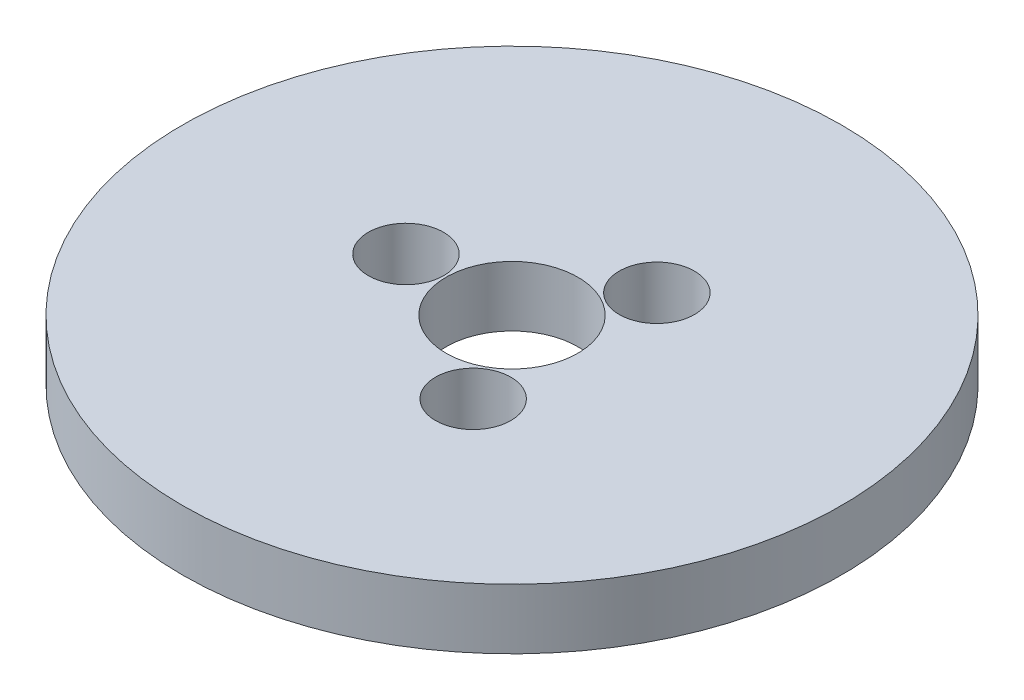
ISO-10303-21;
HEADER;
FILE_DESCRIPTION(('STEP AP214'),'2;1');
FILE_NAME('part.step','',(''),(''),'','','');
FILE_SCHEMA(('AUTOMOTIVE_DESIGN { 1 0 10303 214 1 1 1 1 }'));
ENDSEC;
DATA;
#1=APPLICATION_CONTEXT('core data for automotive mechanical design processes');
#2=APPLICATION_PROTOCOL_DEFINITION('international standard','automotive_design',2000,#1);
#3=PRODUCT_CONTEXT('',#1,'mechanical');
#4=PRODUCT('Part','Part','',(#3));
#5=PRODUCT_RELATED_PRODUCT_CATEGORY('part','',(#4));
#6=PRODUCT_DEFINITION_FORMATION('','',#4);
#7=PRODUCT_DEFINITION_CONTEXT('part definition',#1,'design');
#8=PRODUCT_DEFINITION('design','',#6,#7);
#9=PRODUCT_DEFINITION_SHAPE('','',#8);
#10=(LENGTH_UNIT() NAMED_UNIT(*) SI_UNIT(.MILLI.,.METRE.));
#11=(NAMED_UNIT(*) PLANE_ANGLE_UNIT() SI_UNIT($,.RADIAN.));
#12=(NAMED_UNIT(*) SI_UNIT($,.STERADIAN.) SOLID_ANGLE_UNIT());
#13=UNCERTAINTY_MEASURE_WITH_UNIT(LENGTH_MEASURE(1.E-05),#10,'distance_accuracy_value','');
#14=(GEOMETRIC_REPRESENTATION_CONTEXT(3) GLOBAL_UNCERTAINTY_ASSIGNED_CONTEXT((#13)) GLOBAL_UNIT_ASSIGNED_CONTEXT((#10,
#11,#12)) REPRESENTATION_CONTEXT('',''));
#15=CARTESIAN_POINT('',(0.,0.,0.));
#16=DIRECTION('',(0.,0.,1.));
#17=DIRECTION('',(1.,0.,0.));
#18=AXIS2_PLACEMENT_3D('',#15,#16,#17);
#19=CARTESIAN_POINT('',(0.,16.,0.));
#20=DIRECTION('',(0.,-1.,0.));
#21=DIRECTION('',(0.,0.,-1.));
#22=AXIS2_PLACEMENT_3D('',#19,#20,#21);
#23=CYLINDRICAL_SURFACE('',#22,87.5);
#24=CARTESIAN_POINT('',(0.,16.,0.));
#25=DIRECTION('',(0.,1.,0.));
#26=DIRECTION('',(0.,0.,1.));
#27=AXIS2_PLACEMENT_3D('',#24,#25,#26);
#28=CIRCLE('',#27,87.5);
#29=CARTESIAN_POINT('',(0.,16.,87.5));
#30=VERTEX_POINT('',#29);
#31=EDGE_CURVE('E10',#30,#30,#28,.T.);
#32=ORIENTED_EDGE('',*,*,#31,.F.);
#33=EDGE_LOOP('',(#32));
#34=FACE_BOUND('',#33,.T.);
#35=CARTESIAN_POINT('',(0.,0.,0.));
#36=DIRECTION('',(0.,1.,0.));
#37=DIRECTION('',(0.,0.,1.));
#38=AXIS2_PLACEMENT_3D('',#35,#36,#37);
#39=CIRCLE('',#38,87.5);
#40=CARTESIAN_POINT('',(0.,0.,87.5));
#41=VERTEX_POINT('',#40);
#42=EDGE_CURVE('E37',#41,#41,#39,.T.);
#43=ORIENTED_EDGE('',*,*,#42,.T.);
#44=EDGE_LOOP('',(#43));
#45=FACE_BOUND('',#44,.T.);
#46=ADVANCED_FACE('F40',(#34,#45),#23,.T.);
#47=CARTESIAN_POINT('',(0.,16.,0.));
#48=DIRECTION('',(0.,1.,0.));
#49=DIRECTION('',(0.,0.,1.));
#50=AXIS2_PLACEMENT_3D('',#47,#48,#49);
#51=PLANE('',#50);
#52=CARTESIAN_POINT('',(14.0787727921057,16.,24.3851497841452));
#53=DIRECTION('',(0.,1.,0.));
#54=DIRECTION('',(0.866025403784436,0.,-0.500000000000004));
#55=AXIS2_PLACEMENT_3D('',#52,#53,#54);
#56=CIRCLE('',#55,10.);
#57=CARTESIAN_POINT('',(14.0787727921057,16.,34.3851497841452));
#58=VERTEX_POINT('',#57);
#59=EDGE_CURVE('E70',#58,#58,#56,.T.);
#60=ORIENTED_EDGE('',*,*,#59,.F.);
#61=EDGE_LOOP('',(#60));
#62=FACE_BOUND('',#61,.T.);
#63=CARTESIAN_POINT('',(14.0787727921054,16.,-24.3851497841454));
#64=DIRECTION('',(0.,1.,0.));
#65=DIRECTION('',(-0.866025403784443,0.,-0.499999999999992));
#66=AXIS2_PLACEMENT_3D('',#63,#64,#65);
#67=CIRCLE('',#66,10.);
#68=CARTESIAN_POINT('',(14.0787727921054,16.,-14.3851497841454));
#69=VERTEX_POINT('',#68);
#70=EDGE_CURVE('E61',#69,#69,#67,.T.);
#71=ORIENTED_EDGE('',*,*,#70,.F.);
#72=EDGE_LOOP('',(#71));
#73=FACE_BOUND('',#72,.T.);
#74=CARTESIAN_POINT('',(-28.1575455842112,16.,0.));
#75=DIRECTION('',(0.,1.,0.));
#76=DIRECTION('',(0.,0.,1.));
#77=AXIS2_PLACEMENT_3D('',#74,#75,#76);
#78=CIRCLE('',#77,10.);
#79=CARTESIAN_POINT('',(-28.1575455842112,16.,10.));
#80=VERTEX_POINT('',#79);
#81=EDGE_CURVE('E54',#80,#80,#78,.T.);
#82=ORIENTED_EDGE('',*,*,#81,.F.);
#83=EDGE_LOOP('',(#82));
#84=FACE_BOUND('',#83,.T.);
#85=CARTESIAN_POINT('',(0.,16.,0.));
#86=DIRECTION('',(0.,1.,0.));
#87=DIRECTION('',(0.,0.,1.));
#88=AXIS2_PLACEMENT_3D('',#85,#86,#87);
#89=CIRCLE('',#88,17.5);
#90=CARTESIAN_POINT('',(0.,16.,17.5));
#91=VERTEX_POINT('',#90);
#92=EDGE_CURVE('E50',#91,#91,#89,.T.);
#93=ORIENTED_EDGE('',*,*,#92,.F.);
#94=EDGE_LOOP('',(#93));
#95=FACE_BOUND('',#94,.T.);
#96=ORIENTED_EDGE('',*,*,#31,.T.);
#97=EDGE_LOOP('',(#96));
#98=FACE_BOUND('',#97,.T.);
#99=ADVANCED_FACE('F85',(#62,#73,#84,#95,#98),#51,.T.);
#100=CARTESIAN_POINT('',(0.,0.,0.));
#101=DIRECTION('',(0.,1.,0.));
#102=DIRECTION('',(0.,0.,1.));
#103=AXIS2_PLACEMENT_3D('',#100,#101,#102);
#104=PLANE('',#103);
#105=CARTESIAN_POINT('',(0.,0.,0.));
#106=DIRECTION('',(0.,1.,0.));
#107=DIRECTION('',(0.,0.,1.));
#108=AXIS2_PLACEMENT_3D('',#105,#106,#107);
#109=CIRCLE('',#108,17.5);
#110=CARTESIAN_POINT('',(0.,0.,17.5));
#111=VERTEX_POINT('',#110);
#112=EDGE_CURVE('E47',#111,#111,#109,.T.);
#113=ORIENTED_EDGE('',*,*,#112,.T.);
#114=EDGE_LOOP('',(#113));
#115=FACE_BOUND('',#114,.T.);
#116=ORIENTED_EDGE('',*,*,#42,.F.);
#117=EDGE_LOOP('',(#116));
#118=FACE_BOUND('',#117,.T.);
#119=ADVANCED_FACE('F84',(#115,#118),#104,.F.);
#120=CARTESIAN_POINT('',(0.,16.,0.));
#121=DIRECTION('',(0.,-1.,0.));
#122=DIRECTION('',(0.,0.,-1.));
#123=AXIS2_PLACEMENT_3D('',#120,#121,#122);
#124=CYLINDRICAL_SURFACE('',#123,17.5);
#125=ORIENTED_EDGE('',*,*,#92,.T.);
#126=EDGE_LOOP('',(#125));
#127=FACE_BOUND('',#126,.T.);
#128=ORIENTED_EDGE('',*,*,#112,.F.);
#129=EDGE_LOOP('',(#128));
#130=FACE_BOUND('',#129,.T.);
#131=ADVANCED_FACE('F91',(#127,#130),#124,.F.);
#132=CARTESIAN_POINT('',(-28.1575455842112,1.34580413618511,0.));
#133=DIRECTION('',(0.,1.,0.));
#134=DIRECTION('',(0.,0.,1.));
#135=AXIS2_PLACEMENT_3D('',#132,#133,#134);
#136=CYLINDRICAL_SURFACE('',#135,10.);
#137=CARTESIAN_POINT('',(-28.1575455842112,1.34580413618511,0.));
#138=DIRECTION('',(0.,1.,0.));
#139=DIRECTION('',(0.,0.,1.));
#140=AXIS2_PLACEMENT_3D('',#137,#138,#139);
#141=CIRCLE('',#140,10.);
#142=CARTESIAN_POINT('',(-28.1575455842112,1.34580413618511,10.));
#143=VERTEX_POINT('',#142);
#144=EDGE_CURVE('E55',#143,#143,#141,.T.);
#145=CARTESIAN_POINT('',(-28.1575455842112,1.34580413618511,10.));
#146=CARTESIAN_POINT('',(-28.1575455842112,1.49845200976652,10.));
#147=CARTESIAN_POINT('',(-28.1575455842112,1.65109988334792,10.));
#148=CARTESIAN_POINT('',(-28.1575455842112,1.95639563051073,10.));
#149=CARTESIAN_POINT('',(-28.1575455842112,2.10904350409214,10.));
#150=CARTESIAN_POINT('',(-28.1575455842112,2.41433925125495,10.));
#151=CARTESIAN_POINT('',(-28.1575455842112,2.56698712483635,10.));
#152=CARTESIAN_POINT('',(-28.1575455842112,2.87228287199916,10.));
#153=CARTESIAN_POINT('',(-28.1575455842112,3.02493074558057,10.));
#154=CARTESIAN_POINT('',(-28.1575455842112,3.33022649274338,10.));
#155=CARTESIAN_POINT('',(-28.1575455842112,3.48287436632478,10.));
#156=CARTESIAN_POINT('',(-28.1575455842112,3.78817011348759,10.));
#157=CARTESIAN_POINT('',(-28.1575455842112,3.940817987069,10.));
#158=CARTESIAN_POINT('',(-28.1575455842112,4.24611373423181,10.));
#159=CARTESIAN_POINT('',(-28.1575455842112,4.39876160781322,10.));
#160=CARTESIAN_POINT('',(-28.1575455842112,4.70405735497602,10.));
#161=CARTESIAN_POINT('',(-28.1575455842112,4.85670522855743,10.));
#162=CARTESIAN_POINT('',(-28.1575455842112,5.16200097572024,10.));
#163=CARTESIAN_POINT('',(-28.1575455842112,5.31464884930165,10.));
#164=CARTESIAN_POINT('',(-28.1575455842112,5.61994459646445,10.));
#165=CARTESIAN_POINT('',(-28.1575455842112,5.77259247004586,10.));
#166=CARTESIAN_POINT('',(-28.1575455842112,6.07788821720867,10.));
#167=CARTESIAN_POINT('',(-28.1575455842112,6.23053609079008,10.));
#168=CARTESIAN_POINT('',(-28.1575455842112,6.53583183795289,10.));
#169=CARTESIAN_POINT('',(-28.1575455842112,6.68847971153429,10.));
#170=CARTESIAN_POINT('',(-28.1575455842112,6.9937754586971,10.));
#171=CARTESIAN_POINT('',(-28.1575455842112,7.14642333227851,10.));
#172=CARTESIAN_POINT('',(-28.1575455842112,7.45171907944132,10.));
#173=CARTESIAN_POINT('',(-28.1575455842112,7.60436695302272,10.));
#174=CARTESIAN_POINT('',(-28.1575455842112,7.90966270018553,10.));
#175=CARTESIAN_POINT('',(-28.1575455842112,8.06231057376694,10.));
#176=CARTESIAN_POINT('',(-28.1575455842112,8.36760632092975,10.));
#177=CARTESIAN_POINT('',(-28.1575455842112,8.52025419451115,10.));
#178=CARTESIAN_POINT('',(-28.1575455842112,8.82554994167396,10.));
#179=CARTESIAN_POINT('',(-28.1575455842112,8.97819781525537,10.));
#180=CARTESIAN_POINT('',(-28.1575455842112,9.28349356241818,10.));
#181=CARTESIAN_POINT('',(-28.1575455842112,9.43614143599958,10.));
#182=CARTESIAN_POINT('',(-28.1575455842112,9.74143718316239,10.));
#183=CARTESIAN_POINT('',(-28.1575455842112,9.8940850567438,10.));
#184=CARTESIAN_POINT('',(-28.1575455842112,10.1993808039066,10.));
#185=CARTESIAN_POINT('',(-28.1575455842112,10.352028677488,10.));
#186=CARTESIAN_POINT('',(-28.1575455842112,10.6573244246508,10.));
#187=CARTESIAN_POINT('',(-28.1575455842112,10.8099722982322,10.));
#188=CARTESIAN_POINT('',(-28.1575455842112,11.115268045395,10.));
#189=CARTESIAN_POINT('',(-28.1575455842112,11.2679159189764,10.));
#190=CARTESIAN_POINT('',(-28.1575455842112,11.5732116661393,10.));
#191=CARTESIAN_POINT('',(-28.1575455842112,11.7258595397207,10.));
#192=CARTESIAN_POINT('',(-28.1575455842112,12.0311552868835,10.));
#193=CARTESIAN_POINT('',(-28.1575455842112,12.1838031604649,10.));
#194=CARTESIAN_POINT('',(-28.1575455842112,12.4890989076277,10.));
#195=CARTESIAN_POINT('',(-28.1575455842112,12.6417467812091,10.));
#196=CARTESIAN_POINT('',(-28.1575455842112,12.9470425283719,10.));
#197=CARTESIAN_POINT('',(-28.1575455842112,13.0996904019533,10.));
#198=CARTESIAN_POINT('',(-28.1575455842112,13.4049861491161,10.));
#199=CARTESIAN_POINT('',(-28.1575455842112,13.5576340226975,10.));
#200=CARTESIAN_POINT('',(-28.1575455842112,13.8629297698603,10.));
#201=CARTESIAN_POINT('',(-28.1575455842112,14.0155776434417,10.));
#202=CARTESIAN_POINT('',(-28.1575455842112,14.3208733906045,10.));
#203=CARTESIAN_POINT('',(-28.1575455842112,14.4735212641859,10.));
#204=CARTESIAN_POINT('',(-28.1575455842112,14.7788170113488,10.));
#205=CARTESIAN_POINT('',(-28.1575455842112,14.9314648849302,10.));
#206=CARTESIAN_POINT('',(-28.1575455842112,15.236760632093,10.));
#207=CARTESIAN_POINT('',(-28.1575455842112,15.3894085056744,10.));
#208=CARTESIAN_POINT('',(-28.1575455842112,15.6947042528372,10.));
#209=CARTESIAN_POINT('',(-28.1575455842112,15.8473521264186,10.));
#210=CARTESIAN_POINT('',(-28.1575455842112,16.,10.));
#211=B_SPLINE_CURVE_WITH_KNOTS('',3,(#145,#146,#147,#148,#149,#150,#151,#152,#153,#154,#155,
#156,#157,#158,#159,#160,#161,#162,#163,#164,#165,#166,#167,#168,#169,#170,#171,#172,#173,#174,
#175,#176,#177,#178,#179,#180,#181,#182,#183,#184,#185,#186,#187,#188,#189,#190,#191,#192,#193,
#194,#195,#196,#197,#198,#199,#200,#201,#202,#203,#204,#205,#206,#207,#208,#209,#210),
.UNSPECIFIED.,.F.,.F.,(4,2,2,2,2,2,2,2,2,2,2,2,2,2,2,2,2,2,2,2,2,2,2,2,2,2,2,2,2,2,2,2,4),(0.,
0.457943620744215,0.91588724148843,1.37383086223264,1.83177448297686,2.28971810372108,
2.74766172446529,3.20560534520951,3.66354896595372,4.12149258669794,4.57943620744215,
5.03737982818637,5.49532344893058,5.9532670696748,6.41121069041901,6.86915431116323,
7.32709793190744,7.78504155265166,8.24298517339587,8.70092879414009,9.1588724148843,
9.61681603562852,10.0747596563727,10.5327032771169,10.9906468978612,11.4485905186054,
11.9065341393496,12.3644777600938,12.822421380838,13.2803650015822,13.7383086223265,
14.1962522430707,14.6541958638149),.UNSPECIFIED.);
#212=EDGE_CURVE('BSEAM96',#143,#80,#211,.T.);
#213=ORIENTED_EDGE('',*,*,#144,.F.);
#214=ORIENTED_EDGE('',*,*,#81,.T.);
#215=ORIENTED_EDGE('',*,*,#212,.T.);
#216=ORIENTED_EDGE('',*,*,#212,.F.);
#217=EDGE_LOOP('',(#213,#215,#214,#216));
#218=FACE_BOUND('',#217,.T.);
#219=ADVANCED_FACE('F96',(#218),#136,.F.);
#220=CARTESIAN_POINT('',(-28.1575455842112,1.34580413618511,0.));
#221=DIRECTION('',(0.,1.,0.));
#222=DIRECTION('',(0.,0.,1.));
#223=AXIS2_PLACEMENT_3D('',#220,#221,#222);
#224=PLANE('',#223);
#225=ORIENTED_EDGE('',*,*,#144,.T.);
#226=EDGE_LOOP('',(#225));
#227=FACE_BOUND('',#226,.T.);
#228=ADVANCED_FACE('F127',(#227),#224,.T.);
#229=CARTESIAN_POINT('',(14.0787727921054,1.34580413618511,-24.3851497841454));
#230=DIRECTION('',(0.,1.,0.));
#231=DIRECTION('',(0.,0.,1.));
#232=AXIS2_PLACEMENT_3D('',#229,#230,#231);
#233=CYLINDRICAL_SURFACE('',#232,10.);
#234=CARTESIAN_POINT('',(14.0787727921054,1.34580413618511,-24.3851497841454));
#235=DIRECTION('',(0.,1.,0.));
#236=DIRECTION('',(-0.866025403784443,0.,-0.499999999999992));
#237=AXIS2_PLACEMENT_3D('',#234,#235,#236);
#238=CIRCLE('',#237,10.);
#239=CARTESIAN_POINT('',(14.0787727921054,1.34580413618511,-14.3851497841454));
#240=VERTEX_POINT('',#239);
#241=EDGE_CURVE('E63',#240,#240,#238,.T.);
#242=CARTESIAN_POINT('',(14.0787727921054,1.34580413618511,-14.3851497841454));
#243=CARTESIAN_POINT('',(14.0787727921054,1.49845200976652,-14.3851497841454));
#244=CARTESIAN_POINT('',(14.0787727921054,1.65109988334792,-14.3851497841454));
#245=CARTESIAN_POINT('',(14.0787727921054,1.95639563051073,-14.3851497841454));
#246=CARTESIAN_POINT('',(14.0787727921054,2.10904350409214,-14.3851497841454));
#247=CARTESIAN_POINT('',(14.0787727921054,2.41433925125495,-14.3851497841454));
#248=CARTESIAN_POINT('',(14.0787727921054,2.56698712483635,-14.3851497841454));
#249=CARTESIAN_POINT('',(14.0787727921054,2.87228287199916,-14.3851497841454));
#250=CARTESIAN_POINT('',(14.0787727921054,3.02493074558057,-14.3851497841454));
#251=CARTESIAN_POINT('',(14.0787727921054,3.33022649274338,-14.3851497841454));
#252=CARTESIAN_POINT('',(14.0787727921054,3.48287436632478,-14.3851497841454));
#253=CARTESIAN_POINT('',(14.0787727921054,3.78817011348759,-14.3851497841454));
#254=CARTESIAN_POINT('',(14.0787727921054,3.940817987069,-14.3851497841454));
#255=CARTESIAN_POINT('',(14.0787727921054,4.24611373423181,-14.3851497841454));
#256=CARTESIAN_POINT('',(14.0787727921054,4.39876160781322,-14.3851497841454));
#257=CARTESIAN_POINT('',(14.0787727921054,4.70405735497602,-14.3851497841454));
#258=CARTESIAN_POINT('',(14.0787727921054,4.85670522855743,-14.3851497841454));
#259=CARTESIAN_POINT('',(14.0787727921054,5.16200097572024,-14.3851497841454));
#260=CARTESIAN_POINT('',(14.0787727921054,5.31464884930165,-14.3851497841454));
#261=CARTESIAN_POINT('',(14.0787727921054,5.61994459646445,-14.3851497841454));
#262=CARTESIAN_POINT('',(14.0787727921054,5.77259247004586,-14.3851497841454));
#263=CARTESIAN_POINT('',(14.0787727921054,6.07788821720867,-14.3851497841454));
#264=CARTESIAN_POINT('',(14.0787727921054,6.23053609079008,-14.3851497841454));
#265=CARTESIAN_POINT('',(14.0787727921054,6.53583183795289,-14.3851497841454));
#266=CARTESIAN_POINT('',(14.0787727921054,6.68847971153429,-14.3851497841454));
#267=CARTESIAN_POINT('',(14.0787727921054,6.9937754586971,-14.3851497841454));
#268=CARTESIAN_POINT('',(14.0787727921054,7.14642333227851,-14.3851497841454));
#269=CARTESIAN_POINT('',(14.0787727921054,7.45171907944132,-14.3851497841454));
#270=CARTESIAN_POINT('',(14.0787727921054,7.60436695302272,-14.3851497841454));
#271=CARTESIAN_POINT('',(14.0787727921054,7.90966270018553,-14.3851497841454));
#272=CARTESIAN_POINT('',(14.0787727921054,8.06231057376694,-14.3851497841454));
#273=CARTESIAN_POINT('',(14.0787727921054,8.36760632092975,-14.3851497841454));
#274=CARTESIAN_POINT('',(14.0787727921054,8.52025419451115,-14.3851497841454));
#275=CARTESIAN_POINT('',(14.0787727921054,8.82554994167396,-14.3851497841454));
#276=CARTESIAN_POINT('',(14.0787727921054,8.97819781525537,-14.3851497841454));
#277=CARTESIAN_POINT('',(14.0787727921054,9.28349356241818,-14.3851497841454));
#278=CARTESIAN_POINT('',(14.0787727921054,9.43614143599958,-14.3851497841454));
#279=CARTESIAN_POINT('',(14.0787727921054,9.74143718316239,-14.3851497841454));
#280=CARTESIAN_POINT('',(14.0787727921054,9.8940850567438,-14.3851497841454));
#281=CARTESIAN_POINT('',(14.0787727921054,10.1993808039066,-14.3851497841454));
#282=CARTESIAN_POINT('',(14.0787727921054,10.352028677488,-14.3851497841454));
#283=CARTESIAN_POINT('',(14.0787727921054,10.6573244246508,-14.3851497841454));
#284=CARTESIAN_POINT('',(14.0787727921054,10.8099722982322,-14.3851497841454));
#285=CARTESIAN_POINT('',(14.0787727921054,11.115268045395,-14.3851497841454));
#286=CARTESIAN_POINT('',(14.0787727921054,11.2679159189764,-14.3851497841454));
#287=CARTESIAN_POINT('',(14.0787727921054,11.5732116661393,-14.3851497841454));
#288=CARTESIAN_POINT('',(14.0787727921054,11.7258595397207,-14.3851497841454));
#289=CARTESIAN_POINT('',(14.0787727921054,12.0311552868835,-14.3851497841454));
#290=CARTESIAN_POINT('',(14.0787727921054,12.1838031604649,-14.3851497841454));
#291=CARTESIAN_POINT('',(14.0787727921054,12.4890989076277,-14.3851497841454));
#292=CARTESIAN_POINT('',(14.0787727921054,12.6417467812091,-14.3851497841454));
#293=CARTESIAN_POINT('',(14.0787727921054,12.9470425283719,-14.3851497841454));
#294=CARTESIAN_POINT('',(14.0787727921054,13.0996904019533,-14.3851497841454));
#295=CARTESIAN_POINT('',(14.0787727921054,13.4049861491161,-14.3851497841454));
#296=CARTESIAN_POINT('',(14.0787727921054,13.5576340226975,-14.3851497841454));
#297=CARTESIAN_POINT('',(14.0787727921054,13.8629297698603,-14.3851497841454));
#298=CARTESIAN_POINT('',(14.0787727921054,14.0155776434417,-14.3851497841454));
#299=CARTESIAN_POINT('',(14.0787727921054,14.3208733906045,-14.3851497841454));
#300=CARTESIAN_POINT('',(14.0787727921054,14.4735212641859,-14.3851497841454));
#301=CARTESIAN_POINT('',(14.0787727921054,14.7788170113488,-14.3851497841454));
#302=CARTESIAN_POINT('',(14.0787727921054,14.9314648849302,-14.3851497841454));
#303=CARTESIAN_POINT('',(14.0787727921054,15.236760632093,-14.3851497841454));
#304=CARTESIAN_POINT('',(14.0787727921054,15.3894085056744,-14.3851497841454));
#305=CARTESIAN_POINT('',(14.0787727921054,15.6947042528372,-14.3851497841454));
#306=CARTESIAN_POINT('',(14.0787727921054,15.8473521264186,-14.3851497841454));
#307=CARTESIAN_POINT('',(14.0787727921054,16.,-14.3851497841454));
#308=B_SPLINE_CURVE_WITH_KNOTS('',3,(#242,#243,#244,#245,#246,#247,#248,#249,#250,#251,#252,
#253,#254,#255,#256,#257,#258,#259,#260,#261,#262,#263,#264,#265,#266,#267,#268,#269,#270,#271,
#272,#273,#274,#275,#276,#277,#278,#279,#280,#281,#282,#283,#284,#285,#286,#287,#288,#289,#290,
#291,#292,#293,#294,#295,#296,#297,#298,#299,#300,#301,#302,#303,#304,#305,#306,#307),
.UNSPECIFIED.,.F.,.F.,(4,2,2,2,2,2,2,2,2,2,2,2,2,2,2,2,2,2,2,2,2,2,2,2,2,2,2,2,2,2,2,2,4),(0.,
0.457943620744215,0.91588724148843,1.37383086223264,1.83177448297686,2.28971810372108,
2.74766172446529,3.20560534520951,3.66354896595372,4.12149258669794,4.57943620744215,
5.03737982818637,5.49532344893058,5.9532670696748,6.41121069041901,6.86915431116323,
7.32709793190744,7.78504155265166,8.24298517339587,8.70092879414009,9.1588724148843,
9.61681603562852,10.0747596563727,10.5327032771169,10.9906468978612,11.4485905186054,
11.9065341393496,12.3644777600938,12.822421380838,13.2803650015822,13.7383086223265,
14.1962522430707,14.6541958638149),.UNSPECIFIED.);
#309=EDGE_CURVE('BSEAM133',#240,#69,#308,.T.);
#310=ORIENTED_EDGE('',*,*,#241,.F.);
#311=ORIENTED_EDGE('',*,*,#70,.T.);
#312=ORIENTED_EDGE('',*,*,#309,.T.);
#313=ORIENTED_EDGE('',*,*,#309,.F.);
#314=EDGE_LOOP('',(#310,#312,#311,#313));
#315=FACE_BOUND('',#314,.T.);
#316=ADVANCED_FACE('F133',(#315),#233,.F.);
#317=CARTESIAN_POINT('',(14.0787727921054,1.34580413618511,-24.3851497841454));
#318=DIRECTION('',(0.,1.,0.));
#319=DIRECTION('',(-0.866025403784443,0.,-0.499999999999992));
#320=AXIS2_PLACEMENT_3D('',#317,#318,#319);
#321=PLANE('',#320);
#322=ORIENTED_EDGE('',*,*,#241,.T.);
#323=EDGE_LOOP('',(#322));
#324=FACE_BOUND('',#323,.T.);
#325=ADVANCED_FACE('F77',(#324),#321,.T.);
#326=CARTESIAN_POINT('',(14.0787727921057,1.34580413618511,24.3851497841452));
#327=DIRECTION('',(0.,1.,0.));
#328=DIRECTION('',(0.,0.,1.));
#329=AXIS2_PLACEMENT_3D('',#326,#327,#328);
#330=CYLINDRICAL_SURFACE('',#329,10.);
#331=CARTESIAN_POINT('',(14.0787727921057,1.34580413618511,24.3851497841452));
#332=DIRECTION('',(0.,1.,0.));
#333=DIRECTION('',(0.866025403784436,0.,-0.500000000000004));
#334=AXIS2_PLACEMENT_3D('',#331,#332,#333);
#335=CIRCLE('',#334,10.);
#336=CARTESIAN_POINT('',(14.0787727921057,1.34580413618511,34.3851497841452));
#337=VERTEX_POINT('',#336);
#338=EDGE_CURVE('E59',#337,#337,#335,.T.);
#339=CARTESIAN_POINT('',(14.0787727921057,1.34580413618511,34.3851497841452));
#340=CARTESIAN_POINT('',(14.0787727921057,1.49845200976652,34.3851497841452));
#341=CARTESIAN_POINT('',(14.0787727921057,1.65109988334792,34.3851497841452));
#342=CARTESIAN_POINT('',(14.0787727921057,1.95639563051073,34.3851497841452));
#343=CARTESIAN_POINT('',(14.0787727921057,2.10904350409214,34.3851497841452));
#344=CARTESIAN_POINT('',(14.0787727921057,2.41433925125495,34.3851497841452));
#345=CARTESIAN_POINT('',(14.0787727921057,2.56698712483635,34.3851497841452));
#346=CARTESIAN_POINT('',(14.0787727921057,2.87228287199916,34.3851497841452));
#347=CARTESIAN_POINT('',(14.0787727921057,3.02493074558057,34.3851497841452));
#348=CARTESIAN_POINT('',(14.0787727921057,3.33022649274338,34.3851497841452));
#349=CARTESIAN_POINT('',(14.0787727921057,3.48287436632478,34.3851497841452));
#350=CARTESIAN_POINT('',(14.0787727921057,3.78817011348759,34.3851497841452));
#351=CARTESIAN_POINT('',(14.0787727921057,3.940817987069,34.3851497841452));
#352=CARTESIAN_POINT('',(14.0787727921057,4.24611373423181,34.3851497841452));
#353=CARTESIAN_POINT('',(14.0787727921057,4.39876160781322,34.3851497841452));
#354=CARTESIAN_POINT('',(14.0787727921057,4.70405735497602,34.3851497841452));
#355=CARTESIAN_POINT('',(14.0787727921057,4.85670522855743,34.3851497841452));
#356=CARTESIAN_POINT('',(14.0787727921057,5.16200097572024,34.3851497841452));
#357=CARTESIAN_POINT('',(14.0787727921057,5.31464884930165,34.3851497841452));
#358=CARTESIAN_POINT('',(14.0787727921057,5.61994459646445,34.3851497841452));
#359=CARTESIAN_POINT('',(14.0787727921057,5.77259247004586,34.3851497841452));
#360=CARTESIAN_POINT('',(14.0787727921057,6.07788821720867,34.3851497841452));
#361=CARTESIAN_POINT('',(14.0787727921057,6.23053609079008,34.3851497841452));
#362=CARTESIAN_POINT('',(14.0787727921057,6.53583183795289,34.3851497841452));
#363=CARTESIAN_POINT('',(14.0787727921057,6.68847971153429,34.3851497841452));
#364=CARTESIAN_POINT('',(14.0787727921057,6.9937754586971,34.3851497841452));
#365=CARTESIAN_POINT('',(14.0787727921057,7.14642333227851,34.3851497841452));
#366=CARTESIAN_POINT('',(14.0787727921057,7.45171907944132,34.3851497841452));
#367=CARTESIAN_POINT('',(14.0787727921057,7.60436695302272,34.3851497841452));
#368=CARTESIAN_POINT('',(14.0787727921057,7.90966270018553,34.3851497841452));
#369=CARTESIAN_POINT('',(14.0787727921057,8.06231057376694,34.3851497841452));
#370=CARTESIAN_POINT('',(14.0787727921057,8.36760632092975,34.3851497841452));
#371=CARTESIAN_POINT('',(14.0787727921057,8.52025419451115,34.3851497841452));
#372=CARTESIAN_POINT('',(14.0787727921057,8.82554994167396,34.3851497841452));
#373=CARTESIAN_POINT('',(14.0787727921057,8.97819781525537,34.3851497841452));
#374=CARTESIAN_POINT('',(14.0787727921057,9.28349356241818,34.3851497841452));
#375=CARTESIAN_POINT('',(14.0787727921057,9.43614143599958,34.3851497841452));
#376=CARTESIAN_POINT('',(14.0787727921057,9.74143718316239,34.3851497841452));
#377=CARTESIAN_POINT('',(14.0787727921057,9.8940850567438,34.3851497841452));
#378=CARTESIAN_POINT('',(14.0787727921057,10.1993808039066,34.3851497841452));
#379=CARTESIAN_POINT('',(14.0787727921057,10.352028677488,34.3851497841452));
#380=CARTESIAN_POINT('',(14.0787727921057,10.6573244246508,34.3851497841452));
#381=CARTESIAN_POINT('',(14.0787727921057,10.8099722982322,34.3851497841452));
#382=CARTESIAN_POINT('',(14.0787727921057,11.115268045395,34.3851497841452));
#383=CARTESIAN_POINT('',(14.0787727921057,11.2679159189764,34.3851497841452));
#384=CARTESIAN_POINT('',(14.0787727921057,11.5732116661393,34.3851497841452));
#385=CARTESIAN_POINT('',(14.0787727921057,11.7258595397207,34.3851497841452));
#386=CARTESIAN_POINT('',(14.0787727921057,12.0311552868835,34.3851497841452));
#387=CARTESIAN_POINT('',(14.0787727921057,12.1838031604649,34.3851497841452));
#388=CARTESIAN_POINT('',(14.0787727921057,12.4890989076277,34.3851497841452));
#389=CARTESIAN_POINT('',(14.0787727921057,12.6417467812091,34.3851497841452));
#390=CARTESIAN_POINT('',(14.0787727921057,12.9470425283719,34.3851497841452));
#391=CARTESIAN_POINT('',(14.0787727921057,13.0996904019533,34.3851497841452));
#392=CARTESIAN_POINT('',(14.0787727921057,13.4049861491161,34.3851497841452));
#393=CARTESIAN_POINT('',(14.0787727921057,13.5576340226975,34.3851497841452));
#394=CARTESIAN_POINT('',(14.0787727921057,13.8629297698603,34.3851497841452));
#395=CARTESIAN_POINT('',(14.0787727921057,14.0155776434417,34.3851497841452));
#396=CARTESIAN_POINT('',(14.0787727921057,14.3208733906045,34.3851497841452));
#397=CARTESIAN_POINT('',(14.0787727921057,14.4735212641859,34.3851497841452));
#398=CARTESIAN_POINT('',(14.0787727921057,14.7788170113488,34.3851497841452));
#399=CARTESIAN_POINT('',(14.0787727921057,14.9314648849302,34.3851497841452));
#400=CARTESIAN_POINT('',(14.0787727921057,15.236760632093,34.3851497841452));
#401=CARTESIAN_POINT('',(14.0787727921057,15.3894085056744,34.3851497841452));
#402=CARTESIAN_POINT('',(14.0787727921057,15.6947042528372,34.3851497841452));
#403=CARTESIAN_POINT('',(14.0787727921057,15.8473521264186,34.3851497841452));
#404=CARTESIAN_POINT('',(14.0787727921057,16.,34.3851497841452));
#405=B_SPLINE_CURVE_WITH_KNOTS('',3,(#339,#340,#341,#342,#343,#344,#345,#346,#347,#348,#349,
#350,#351,#352,#353,#354,#355,#356,#357,#358,#359,#360,#361,#362,#363,#364,#365,#366,#367,#368,
#369,#370,#371,#372,#373,#374,#375,#376,#377,#378,#379,#380,#381,#382,#383,#384,#385,#386,#387,
#388,#389,#390,#391,#392,#393,#394,#395,#396,#397,#398,#399,#400,#401,#402,#403,#404),
.UNSPECIFIED.,.F.,.F.,(4,2,2,2,2,2,2,2,2,2,2,2,2,2,2,2,2,2,2,2,2,2,2,2,2,2,2,2,2,2,2,2,4),(0.,
0.457943620744215,0.91588724148843,1.37383086223264,1.83177448297686,2.28971810372108,
2.74766172446529,3.20560534520951,3.66354896595372,4.12149258669794,4.57943620744215,
5.03737982818637,5.49532344893058,5.9532670696748,6.41121069041901,6.86915431116323,
7.32709793190744,7.78504155265166,8.24298517339587,8.70092879414009,9.1588724148843,
9.61681603562852,10.0747596563727,10.5327032771169,10.9906468978612,11.4485905186054,
11.9065341393496,12.3644777600938,12.822421380838,13.2803650015822,13.7383086223265,
14.1962522430707,14.6541958638149),.UNSPECIFIED.);
#406=EDGE_CURVE('BSEAM73',#337,#58,#405,.T.);
#407=ORIENTED_EDGE('',*,*,#338,.F.);
#408=ORIENTED_EDGE('',*,*,#59,.T.);
#409=ORIENTED_EDGE('',*,*,#406,.T.);
#410=ORIENTED_EDGE('',*,*,#406,.F.);
#411=EDGE_LOOP('',(#407,#409,#408,#410));
#412=FACE_BOUND('',#411,.T.);
#413=ADVANCED_FACE('F73',(#412),#330,.F.);
#414=CARTESIAN_POINT('',(14.0787727921057,1.34580413618511,24.3851497841452));
#415=DIRECTION('',(0.,1.,0.));
#416=DIRECTION('',(0.866025403784436,0.,-0.500000000000004));
#417=AXIS2_PLACEMENT_3D('',#414,#415,#416);
#418=PLANE('',#417);
#419=ORIENTED_EDGE('',*,*,#338,.T.);
#420=EDGE_LOOP('',(#419));
#421=FACE_BOUND('',#420,.T.);
#422=ADVANCED_FACE('F71',(#421),#418,.T.);
#423=CLOSED_SHELL('',(#46,#99,#119,#131,#219,#228,#316,#325,#413,#422));
#424=MANIFOLD_SOLID_BREP('B2',#423);
#425=ADVANCED_BREP_SHAPE_REPRESENTATION('',(#18,#424),#14);
#426=SHAPE_DEFINITION_REPRESENTATION(#9,#425);
ENDSEC;
END-ISO-10303-21;
